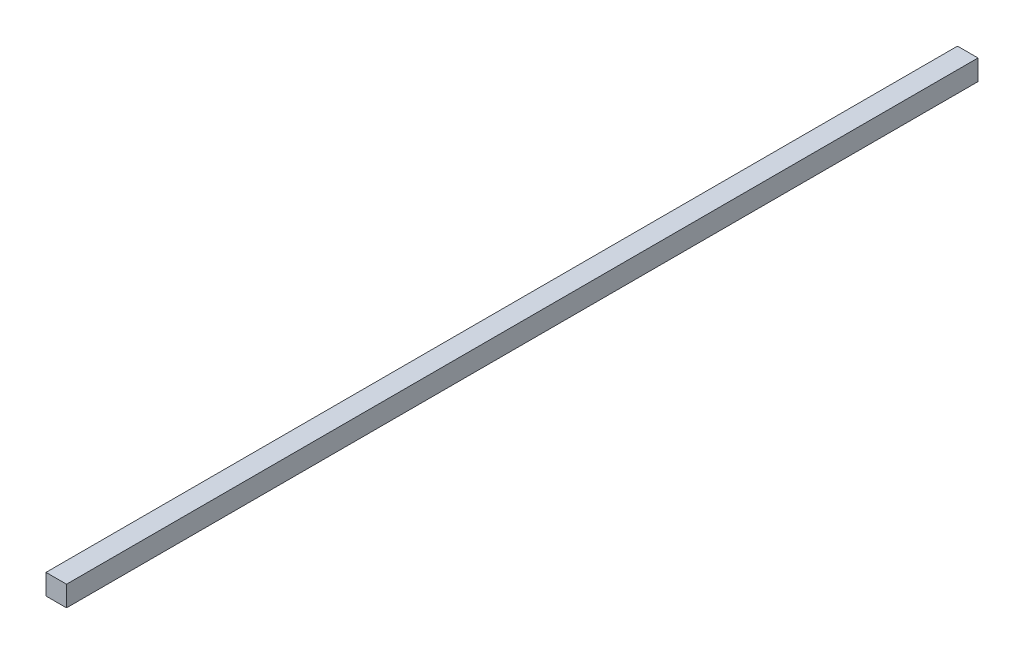
ISO-10303-21;
HEADER;
FILE_DESCRIPTION(('STEP AP214'),'2;1');
FILE_NAME('part.step','',(''),(''),'','','');
FILE_SCHEMA(('AUTOMOTIVE_DESIGN { 1 0 10303 214 1 1 1 1 }'));
ENDSEC;
DATA;
#1=APPLICATION_CONTEXT('core data for automotive mechanical design processes');
#2=APPLICATION_PROTOCOL_DEFINITION('international standard','automotive_design',2000,#1);
#3=PRODUCT_CONTEXT('',#1,'mechanical');
#4=PRODUCT('Part','Part','',(#3));
#5=PRODUCT_RELATED_PRODUCT_CATEGORY('part','',(#4));
#6=PRODUCT_DEFINITION_FORMATION('','',#4);
#7=PRODUCT_DEFINITION_CONTEXT('part definition',#1,'design');
#8=PRODUCT_DEFINITION('design','',#6,#7);
#9=PRODUCT_DEFINITION_SHAPE('','',#8);
#10=(LENGTH_UNIT() NAMED_UNIT(*) SI_UNIT(.MILLI.,.METRE.));
#11=(NAMED_UNIT(*) PLANE_ANGLE_UNIT() SI_UNIT($,.RADIAN.));
#12=(NAMED_UNIT(*) SI_UNIT($,.STERADIAN.) SOLID_ANGLE_UNIT());
#13=UNCERTAINTY_MEASURE_WITH_UNIT(LENGTH_MEASURE(1.E-05),#10,'distance_accuracy_value','');
#14=(GEOMETRIC_REPRESENTATION_CONTEXT(3) GLOBAL_UNCERTAINTY_ASSIGNED_CONTEXT((#13)) GLOBAL_UNIT_ASSIGNED_CONTEXT((#10,
#11,#12)) REPRESENTATION_CONTEXT('',''));
#15=CARTESIAN_POINT('',(0.,0.,0.));
#16=DIRECTION('',(0.,0.,1.));
#17=DIRECTION('',(1.,0.,0.));
#18=AXIS2_PLACEMENT_3D('',#15,#16,#17);
#19=CARTESIAN_POINT('',(0.,0.,2000.));
#20=DIRECTION('',(1.,0.,0.));
#21=DIRECTION('',(0.,0.,-1.));
#22=AXIS2_PLACEMENT_3D('',#19,#20,#21);
#23=PLANE('',#22);
#24=DIRECTION('',(0.,-1.,0.));
#25=VECTOR('',#24,1.);
#26=CARTESIAN_POINT('',(0.,0.,0.));
#27=LINE('',#26,#25);
#28=CARTESIAN_POINT('',(0.,45.,0.));
#29=VERTEX_POINT('',#28);
#30=CARTESIAN_POINT('',(0.,0.,0.));
#31=VERTEX_POINT('',#30);
#32=EDGE_CURVE('E107',#29,#31,#27,.T.);
#33=ORIENTED_EDGE('',*,*,#32,.T.);
#34=DIRECTION('',(0.,0.,-1.));
#35=VECTOR('',#34,1.);
#36=CARTESIAN_POINT('',(0.,0.,2000.));
#37=LINE('',#36,#35);
#38=CARTESIAN_POINT('',(0.,0.,2000.));
#39=VERTEX_POINT('',#38);
#40=EDGE_CURVE('E11',#39,#31,#37,.T.);
#41=ORIENTED_EDGE('',*,*,#40,.F.);
#42=DIRECTION('',(0.,-1.,0.));
#43=VECTOR('',#42,1.);
#44=CARTESIAN_POINT('',(0.,0.,2000.));
#45=LINE('',#44,#43);
#46=CARTESIAN_POINT('',(0.,45.,2000.));
#47=VERTEX_POINT('',#46);
#48=EDGE_CURVE('E91',#47,#39,#45,.T.);
#49=ORIENTED_EDGE('',*,*,#48,.F.);
#50=DIRECTION('',(0.,0.,-1.));
#51=VECTOR('',#50,1.);
#52=CARTESIAN_POINT('',(0.,45.,2000.));
#53=LINE('',#52,#51);
#54=EDGE_CURVE('E103',#47,#29,#53,.T.);
#55=ORIENTED_EDGE('',*,*,#54,.T.);
#56=EDGE_LOOP('',(#33,#41,#49,#55));
#57=FACE_BOUND('',#56,.T.);
#58=ADVANCED_FACE('F39',(#57),#23,.F.);
#59=CARTESIAN_POINT('',(0.,0.,2000.));
#60=DIRECTION('',(0.,1.,0.));
#61=DIRECTION('',(0.,0.,1.));
#62=AXIS2_PLACEMENT_3D('',#59,#60,#61);
#63=PLANE('',#62);
#64=DIRECTION('',(1.,0.,0.));
#65=VECTOR('',#64,1.);
#66=CARTESIAN_POINT('',(0.,0.,0.));
#67=LINE('',#66,#65);
#68=CARTESIAN_POINT('',(45.,0.,0.));
#69=VERTEX_POINT('',#68);
#70=EDGE_CURVE('E96',#31,#69,#67,.T.);
#71=ORIENTED_EDGE('',*,*,#70,.T.);
#72=DIRECTION('',(0.,0.,-1.));
#73=VECTOR('',#72,1.);
#74=CARTESIAN_POINT('',(45.,0.,2000.));
#75=LINE('',#74,#73);
#76=CARTESIAN_POINT('',(45.,0.,2000.));
#77=VERTEX_POINT('',#76);
#78=EDGE_CURVE('E48',#77,#69,#75,.T.);
#79=ORIENTED_EDGE('',*,*,#78,.F.);
#80=DIRECTION('',(1.,0.,0.));
#81=VECTOR('',#80,1.);
#82=CARTESIAN_POINT('',(0.,0.,2000.));
#83=LINE('',#82,#81);
#84=EDGE_CURVE('E86',#39,#77,#83,.T.);
#85=ORIENTED_EDGE('',*,*,#84,.F.);
#86=ORIENTED_EDGE('',*,*,#40,.T.);
#87=EDGE_LOOP('',(#71,#79,#85,#86));
#88=FACE_BOUND('',#87,.T.);
#89=ADVANCED_FACE('F95',(#88),#63,.F.);
#90=CARTESIAN_POINT('',(45.,0.,2000.));
#91=DIRECTION('',(-1.,0.,0.));
#92=DIRECTION('',(0.,0.,1.));
#93=AXIS2_PLACEMENT_3D('',#90,#91,#92);
#94=PLANE('',#93);
#95=DIRECTION('',(0.,1.,0.));
#96=VECTOR('',#95,1.);
#97=CARTESIAN_POINT('',(45.,0.,0.));
#98=LINE('',#97,#96);
#99=CARTESIAN_POINT('',(45.,45.,0.));
#100=VERTEX_POINT('',#99);
#101=EDGE_CURVE('E73',#69,#100,#98,.T.);
#102=ORIENTED_EDGE('',*,*,#101,.T.);
#103=DIRECTION('',(0.,0.,-1.));
#104=VECTOR('',#103,1.);
#105=CARTESIAN_POINT('',(45.,45.,2000.));
#106=LINE('',#105,#104);
#107=CARTESIAN_POINT('',(45.,45.,2000.));
#108=VERTEX_POINT('',#107);
#109=EDGE_CURVE('E98',#108,#100,#106,.T.);
#110=ORIENTED_EDGE('',*,*,#109,.F.);
#111=DIRECTION('',(0.,1.,0.));
#112=VECTOR('',#111,1.);
#113=CARTESIAN_POINT('',(45.,0.,2000.));
#114=LINE('',#113,#112);
#115=EDGE_CURVE('E89',#77,#108,#114,.T.);
#116=ORIENTED_EDGE('',*,*,#115,.F.);
#117=ORIENTED_EDGE('',*,*,#78,.T.);
#118=EDGE_LOOP('',(#102,#110,#116,#117));
#119=FACE_BOUND('',#118,.T.);
#120=ADVANCED_FACE('F99',(#119),#94,.F.);
#121=CARTESIAN_POINT('',(0.,45.,2000.));
#122=DIRECTION('',(0.,-1.,0.));
#123=DIRECTION('',(0.,0.,-1.));
#124=AXIS2_PLACEMENT_3D('',#121,#122,#123);
#125=PLANE('',#124);
#126=DIRECTION('',(-1.,0.,0.));
#127=VECTOR('',#126,1.);
#128=CARTESIAN_POINT('',(0.,45.,0.));
#129=LINE('',#128,#127);
#130=EDGE_CURVE('E79',#100,#29,#129,.T.);
#131=ORIENTED_EDGE('',*,*,#130,.T.);
#132=ORIENTED_EDGE('',*,*,#54,.F.);
#133=DIRECTION('',(-1.,0.,0.));
#134=VECTOR('',#133,1.);
#135=CARTESIAN_POINT('',(0.,45.,2000.));
#136=LINE('',#135,#134);
#137=EDGE_CURVE('E56',#108,#47,#136,.T.);
#138=ORIENTED_EDGE('',*,*,#137,.F.);
#139=ORIENTED_EDGE('',*,*,#109,.T.);
#140=EDGE_LOOP('',(#131,#132,#138,#139));
#141=FACE_BOUND('',#140,.T.);
#142=ADVANCED_FACE('F120',(#141),#125,.F.);
#143=CARTESIAN_POINT('',(0.,0.,2000.));
#144=DIRECTION('',(0.,0.,-1.));
#145=DIRECTION('',(-1.,0.,0.));
#146=AXIS2_PLACEMENT_3D('',#143,#144,#145);
#147=PLANE('',#146);
#148=ORIENTED_EDGE('',*,*,#48,.T.);
#149=ORIENTED_EDGE('',*,*,#84,.T.);
#150=ORIENTED_EDGE('',*,*,#115,.T.);
#151=ORIENTED_EDGE('',*,*,#137,.T.);
#152=EDGE_LOOP('',(#148,#149,#150,#151));
#153=FACE_BOUND('',#152,.T.);
#154=ADVANCED_FACE('F87',(#153),#147,.F.);
#155=CARTESIAN_POINT('',(0.,0.,0.));
#156=DIRECTION('',(0.,0.,-1.));
#157=DIRECTION('',(-1.,0.,0.));
#158=AXIS2_PLACEMENT_3D('',#155,#156,#157);
#159=PLANE('',#158);
#160=ORIENTED_EDGE('',*,*,#32,.F.);
#161=ORIENTED_EDGE('',*,*,#130,.F.);
#162=ORIENTED_EDGE('',*,*,#101,.F.);
#163=ORIENTED_EDGE('',*,*,#70,.F.);
#164=EDGE_LOOP('',(#160,#161,#162,#163));
#165=FACE_BOUND('',#164,.T.);
#166=ADVANCED_FACE('F123',(#165),#159,.T.);
#167=CLOSED_SHELL('',(#58,#89,#120,#142,#154,#166));
#168=MANIFOLD_SOLID_BREP('B2',#167);
#169=ADVANCED_BREP_SHAPE_REPRESENTATION('',(#18,#168),#14);
#170=SHAPE_DEFINITION_REPRESENTATION(#9,#169);
ENDSEC;
END-ISO-10303-21;
